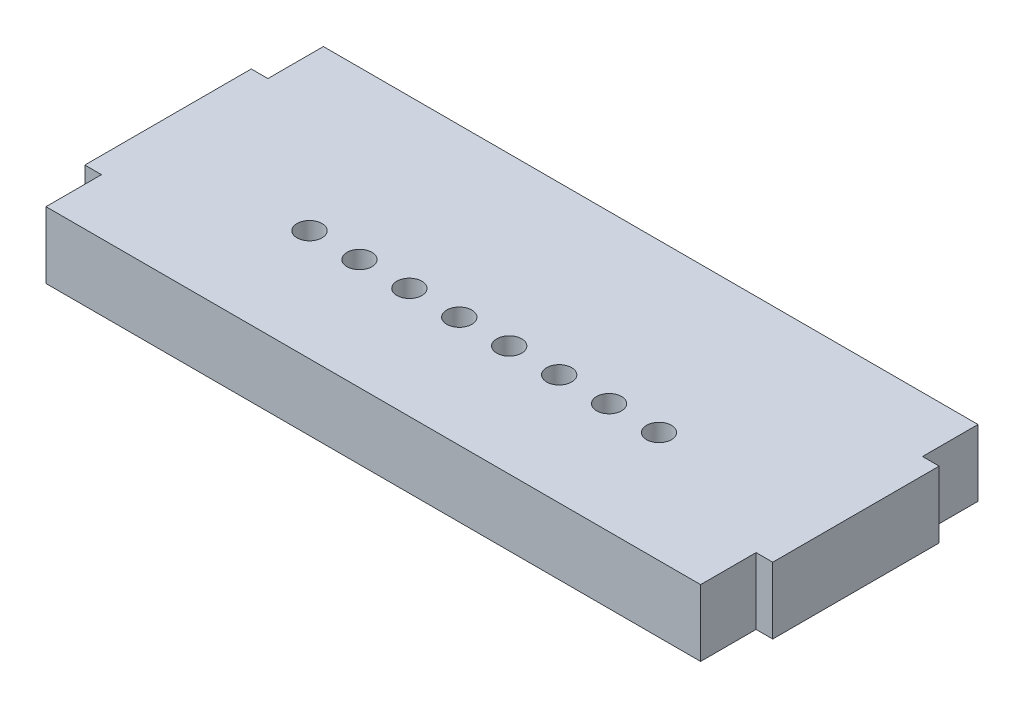
ISO-10303-21;
HEADER;
FILE_DESCRIPTION(('STEP AP214'),'2;1');
FILE_NAME('part.step','',(''),(''),'','','');
FILE_SCHEMA(('AUTOMOTIVE_DESIGN { 1 0 10303 214 1 1 1 1 }'));
ENDSEC;
DATA;
#1=APPLICATION_CONTEXT('core data for automotive mechanical design processes');
#2=APPLICATION_PROTOCOL_DEFINITION('international standard','automotive_design',2000,#1);
#3=PRODUCT_CONTEXT('',#1,'mechanical');
#4=PRODUCT('Part','Part','',(#3));
#5=PRODUCT_RELATED_PRODUCT_CATEGORY('part','',(#4));
#6=PRODUCT_DEFINITION_FORMATION('','',#4);
#7=PRODUCT_DEFINITION_CONTEXT('part definition',#1,'design');
#8=PRODUCT_DEFINITION('design','',#6,#7);
#9=PRODUCT_DEFINITION_SHAPE('','',#8);
#10=(LENGTH_UNIT() NAMED_UNIT(*) SI_UNIT(.MILLI.,.METRE.));
#11=(NAMED_UNIT(*) PLANE_ANGLE_UNIT() SI_UNIT($,.RADIAN.));
#12=(NAMED_UNIT(*) SI_UNIT($,.STERADIAN.) SOLID_ANGLE_UNIT());
#13=UNCERTAINTY_MEASURE_WITH_UNIT(LENGTH_MEASURE(1.E-05),#10,'distance_accuracy_value','');
#14=(GEOMETRIC_REPRESENTATION_CONTEXT(3) GLOBAL_UNCERTAINTY_ASSIGNED_CONTEXT((#13)) GLOBAL_UNIT_ASSIGNED_CONTEXT((#10,
#11,#12)) REPRESENTATION_CONTEXT('',''));
#15=CARTESIAN_POINT('',(0.,0.,0.));
#16=DIRECTION('',(0.,0.,1.));
#17=DIRECTION('',(1.,0.,0.));
#18=AXIS2_PLACEMENT_3D('',#15,#16,#17);
#19=CARTESIAN_POINT('',(-1.5404344466674E-12,12.,149.999999999999));
#20=DIRECTION('',(-1.,0.,0.));
#21=DIRECTION('',(0.,0.,1.));
#22=AXIS2_PLACEMENT_3D('',#19,#20,#21);
#23=PLANE('',#22);
#24=DIRECTION('',(0.,0.,-1.));
#25=VECTOR('',#24,1.);
#26=CARTESIAN_POINT('',(-1.5404344466674E-12,0.,149.999999999999));
#27=LINE('',#26,#25);
#28=CARTESIAN_POINT('',(-1.5404344466674E-12,0.,149.999999999999));
#29=VERTEX_POINT('',#28);
#30=CARTESIAN_POINT('',(-1.5404344466674E-12,0.,139.999999999999));
#31=VERTEX_POINT('',#30);
#32=EDGE_CURVE('E155',#29,#31,#27,.T.);
#33=ORIENTED_EDGE('',*,*,#32,.T.);
#34=DIRECTION('',(0.,-1.,0.));
#35=VECTOR('',#34,1.);
#36=CARTESIAN_POINT('',(-1.5404344466674E-12,12.,139.999999999999));
#37=LINE('',#36,#35);
#38=CARTESIAN_POINT('',(-1.5404344466674E-12,12.,139.999999999999));
#39=VERTEX_POINT('',#38);
#40=EDGE_CURVE('E41',#39,#31,#37,.T.);
#41=ORIENTED_EDGE('',*,*,#40,.F.);
#42=DIRECTION('',(0.,0.,-1.));
#43=VECTOR('',#42,1.);
#44=CARTESIAN_POINT('',(-1.5404344466674E-12,12.,149.999999999999));
#45=LINE('',#44,#43);
#46=CARTESIAN_POINT('',(-1.5404344466674E-12,12.,149.999999999999));
#47=VERTEX_POINT('',#46);
#48=EDGE_CURVE('E184',#47,#39,#45,.T.);
#49=ORIENTED_EDGE('',*,*,#48,.F.);
#50=DIRECTION('',(0.,-1.,0.));
#51=VECTOR('',#50,1.);
#52=CARTESIAN_POINT('',(-1.5404344466674E-12,12.,149.999999999999));
#53=LINE('',#52,#51);
#54=EDGE_CURVE('E56',#47,#29,#53,.T.);
#55=ORIENTED_EDGE('',*,*,#54,.T.);
#56=EDGE_LOOP('',(#33,#41,#49,#55));
#57=FACE_BOUND('',#56,.T.);
#58=ADVANCED_FACE('F34',(#57),#23,.F.);
#59=CARTESIAN_POINT('',(-1.5404344466674E-12,12.,139.999999999999));
#60=DIRECTION('',(0.,0.,-1.));
#61=DIRECTION('',(-1.,0.,0.));
#62=AXIS2_PLACEMENT_3D('',#59,#60,#61);
#63=PLANE('',#62);
#64=DIRECTION('',(1.,0.,0.));
#65=VECTOR('',#64,1.);
#66=CARTESIAN_POINT('',(-1.5404344466674E-12,0.,139.999999999999));
#67=LINE('',#66,#65);
#68=CARTESIAN_POINT('',(2.9999999999983,0.,139.999999999999));
#69=VERTEX_POINT('',#68);
#70=EDGE_CURVE('E157',#31,#69,#67,.T.);
#71=ORIENTED_EDGE('',*,*,#70,.T.);
#72=DIRECTION('',(0.,-1.,0.));
#73=VECTOR('',#72,1.);
#74=CARTESIAN_POINT('',(2.9999999999983,12.,139.999999999999));
#75=LINE('',#74,#73);
#76=CARTESIAN_POINT('',(2.9999999999983,12.,139.999999999999));
#77=VERTEX_POINT('',#76);
#78=EDGE_CURVE('E197',#77,#69,#75,.T.);
#79=ORIENTED_EDGE('',*,*,#78,.F.);
#80=DIRECTION('',(1.,0.,0.));
#81=VECTOR('',#80,1.);
#82=CARTESIAN_POINT('',(-1.5404344466674E-12,12.,139.999999999999));
#83=LINE('',#82,#81);
#84=EDGE_CURVE('E102',#39,#77,#83,.T.);
#85=ORIENTED_EDGE('',*,*,#84,.F.);
#86=ORIENTED_EDGE('',*,*,#40,.T.);
#87=EDGE_LOOP('',(#71,#79,#85,#86));
#88=FACE_BOUND('',#87,.T.);
#89=ADVANCED_FACE('F200',(#88),#63,.F.);
#90=CARTESIAN_POINT('',(2.9999999999983,12.,139.999999999999));
#91=DIRECTION('',(-1.,0.,0.));
#92=DIRECTION('',(0.,0.,1.));
#93=AXIS2_PLACEMENT_3D('',#90,#91,#92);
#94=PLANE('',#93);
#95=DIRECTION('',(0.,0.,-1.));
#96=VECTOR('',#95,1.);
#97=CARTESIAN_POINT('',(2.9999999999983,0.,139.999999999999));
#98=LINE('',#97,#96);
#99=CARTESIAN_POINT('',(2.9999999999983,0.,109.999999999999));
#100=VERTEX_POINT('',#99);
#101=EDGE_CURVE('E160',#69,#100,#98,.T.);
#102=ORIENTED_EDGE('',*,*,#101,.T.);
#103=DIRECTION('',(0.,-1.,0.));
#104=VECTOR('',#103,1.);
#105=CARTESIAN_POINT('',(2.9999999999983,12.,109.999999999999));
#106=LINE('',#105,#104);
#107=CARTESIAN_POINT('',(2.9999999999983,12.,109.999999999999));
#108=VERTEX_POINT('',#107);
#109=EDGE_CURVE('E195',#108,#100,#106,.T.);
#110=ORIENTED_EDGE('',*,*,#109,.F.);
#111=DIRECTION('',(0.,0.,-1.));
#112=VECTOR('',#111,1.);
#113=CARTESIAN_POINT('',(2.9999999999983,12.,139.999999999999));
#114=LINE('',#113,#112);
#115=EDGE_CURVE('E286',#77,#108,#114,.T.);
#116=ORIENTED_EDGE('',*,*,#115,.F.);
#117=ORIENTED_EDGE('',*,*,#78,.T.);
#118=EDGE_LOOP('',(#102,#110,#116,#117));
#119=FACE_BOUND('',#118,.T.);
#120=ADVANCED_FACE('F299',(#119),#94,.F.);
#121=CARTESIAN_POINT('',(-1.62370117351429E-12,12.,109.999999999999));
#122=DIRECTION('',(0.,0.,-1.));
#123=DIRECTION('',(-1.,0.,0.));
#124=AXIS2_PLACEMENT_3D('',#121,#122,#123);
#125=PLANE('',#124);
#126=DIRECTION('',(1.,0.,0.));
#127=VECTOR('',#126,1.);
#128=CARTESIAN_POINT('',(-1.62370117351429E-12,0.,109.999999999999));
#129=LINE('',#128,#127);
#130=CARTESIAN_POINT('',(-1.62370117351429E-12,0.,109.999999999999));
#131=VERTEX_POINT('',#130);
#132=EDGE_CURVE('E163',#131,#100,#129,.T.);
#133=ORIENTED_EDGE('',*,*,#132,.F.);
#134=DIRECTION('',(0.,-1.,0.));
#135=VECTOR('',#134,1.);
#136=CARTESIAN_POINT('',(-1.62370117351429E-12,12.,109.999999999999));
#137=LINE('',#136,#135);
#138=CARTESIAN_POINT('',(-1.62370117351429E-12,12.,109.999999999999));
#139=VERTEX_POINT('',#138);
#140=EDGE_CURVE('E192',#139,#131,#137,.T.);
#141=ORIENTED_EDGE('',*,*,#140,.F.);
#142=DIRECTION('',(1.,0.,0.));
#143=VECTOR('',#142,1.);
#144=CARTESIAN_POINT('',(-1.62370117351429E-12,12.,109.999999999999));
#145=LINE('',#144,#143);
#146=EDGE_CURVE('E288',#139,#108,#145,.T.);
#147=ORIENTED_EDGE('',*,*,#146,.T.);
#148=ORIENTED_EDGE('',*,*,#109,.T.);
#149=EDGE_LOOP('',(#133,#141,#147,#148));
#150=FACE_BOUND('',#149,.T.);
#151=ADVANCED_FACE('F295',(#150),#125,.T.);
#152=CARTESIAN_POINT('',(-1.59594559789866E-12,12.,99.999999999999));
#153=DIRECTION('',(-1.,0.,0.));
#154=DIRECTION('',(0.,0.,1.));
#155=AXIS2_PLACEMENT_3D('',#152,#153,#154);
#156=PLANE('',#155);
#157=DIRECTION('',(0.,0.,-1.));
#158=VECTOR('',#157,1.);
#159=CARTESIAN_POINT('',(-1.59594559789866E-12,0.,99.999999999999));
#160=LINE('',#159,#158);
#161=CARTESIAN_POINT('',(-1.59594559789866E-12,0.,99.9999999999989));
#162=VERTEX_POINT('',#161);
#163=EDGE_CURVE('E166',#131,#162,#160,.T.);
#164=ORIENTED_EDGE('',*,*,#163,.T.);
#165=DIRECTION('',(0.,1.,0.));
#166=VECTOR('',#165,1.);
#167=CARTESIAN_POINT('',(-1.59594559789866E-12,12.,99.999999999999));
#168=LINE('',#167,#166);
#169=CARTESIAN_POINT('',(-1.60982338570648E-12,12.,99.9999999999989));
#170=VERTEX_POINT('',#169);
#171=EDGE_CURVE('E47',#162,#170,#168,.T.);
#172=ORIENTED_EDGE('',*,*,#171,.T.);
#173=DIRECTION('',(0.,0.,-1.));
#174=VECTOR('',#173,1.);
#175=CARTESIAN_POINT('',(-1.62370117351429E-12,12.,109.999999999999));
#176=LINE('',#175,#174);
#177=EDGE_CURVE('E233',#139,#170,#176,.T.);
#178=ORIENTED_EDGE('',*,*,#177,.F.);
#179=ORIENTED_EDGE('',*,*,#140,.T.);
#180=EDGE_LOOP('',(#164,#172,#178,#179));
#181=FACE_BOUND('',#180,.T.);
#182=ADVANCED_FACE('F301',(#181),#156,.F.);
#183=CARTESIAN_POINT('',(-118.000000000001,12.,109.999999999999));
#184=DIRECTION('',(-1.,0.,0.));
#185=DIRECTION('',(0.,0.,1.));
#186=AXIS2_PLACEMENT_3D('',#183,#184,#185);
#187=PLANE('',#186);
#188=DIRECTION('',(0.,1.,0.));
#189=VECTOR('',#188,1.);
#190=CARTESIAN_POINT('',(-118.000000000001,12.,99.9999999999989));
#191=LINE('',#190,#189);
#192=CARTESIAN_POINT('',(-118.000000000001,0.,99.9999999999989));
#193=VERTEX_POINT('',#192);
#194=CARTESIAN_POINT('',(-118.000000000001,12.,99.9999999999989));
#195=VERTEX_POINT('',#194);
#196=EDGE_CURVE('E224',#193,#195,#191,.T.);
#197=ORIENTED_EDGE('',*,*,#196,.F.);
#198=DIRECTION('',(0.,0.,-1.));
#199=VECTOR('',#198,1.);
#200=CARTESIAN_POINT('',(-118.000000000001,0.,109.999999999999));
#201=LINE('',#200,#199);
#202=CARTESIAN_POINT('',(-118.000000000001,0.,109.999999999999));
#203=VERTEX_POINT('',#202);
#204=EDGE_CURVE('E169',#203,#193,#201,.T.);
#205=ORIENTED_EDGE('',*,*,#204,.F.);
#206=DIRECTION('',(0.,-1.,0.));
#207=VECTOR('',#206,1.);
#208=CARTESIAN_POINT('',(-118.000000000001,12.,109.999999999999));
#209=LINE('',#208,#207);
#210=CARTESIAN_POINT('',(-118.000000000001,12.,109.999999999999));
#211=VERTEX_POINT('',#210);
#212=EDGE_CURVE('E190',#211,#203,#209,.T.);
#213=ORIENTED_EDGE('',*,*,#212,.F.);
#214=DIRECTION('',(0.,0.,-1.));
#215=VECTOR('',#214,1.);
#216=CARTESIAN_POINT('',(-118.000000000001,12.,99.9999999999988));
#217=LINE('',#216,#215);
#218=EDGE_CURVE('E222',#211,#195,#217,.T.);
#219=ORIENTED_EDGE('',*,*,#218,.T.);
#220=EDGE_LOOP('',(#197,#205,#213,#219));
#221=FACE_BOUND('',#220,.T.);
#222=ADVANCED_FACE('F220',(#221),#187,.T.);
#223=CARTESIAN_POINT('',(-118.000000000001,12.,109.999999999999));
#224=DIRECTION('',(0.,0.,1.));
#225=DIRECTION('',(1.,0.,0.));
#226=AXIS2_PLACEMENT_3D('',#223,#224,#225);
#227=PLANE('',#226);
#228=DIRECTION('',(-1.,0.,0.));
#229=VECTOR('',#228,1.);
#230=CARTESIAN_POINT('',(-118.000000000001,0.,109.999999999999));
#231=LINE('',#230,#229);
#232=CARTESIAN_POINT('',(-121.000000000002,0.,109.999999999999));
#233=VERTEX_POINT('',#232);
#234=EDGE_CURVE('E172',#203,#233,#231,.T.);
#235=ORIENTED_EDGE('',*,*,#234,.T.);
#236=DIRECTION('',(0.,-1.,0.));
#237=VECTOR('',#236,1.);
#238=CARTESIAN_POINT('',(-121.000000000002,12.,109.999999999999));
#239=LINE('',#238,#237);
#240=CARTESIAN_POINT('',(-121.000000000002,12.,109.999999999999));
#241=VERTEX_POINT('',#240);
#242=EDGE_CURVE('E188',#241,#233,#239,.T.);
#243=ORIENTED_EDGE('',*,*,#242,.F.);
#244=DIRECTION('',(-1.,0.,0.));
#245=VECTOR('',#244,1.);
#246=CARTESIAN_POINT('',(-118.000000000001,12.,109.999999999999));
#247=LINE('',#246,#245);
#248=EDGE_CURVE('E216',#211,#241,#247,.T.);
#249=ORIENTED_EDGE('',*,*,#248,.F.);
#250=ORIENTED_EDGE('',*,*,#212,.T.);
#251=EDGE_LOOP('',(#235,#243,#249,#250));
#252=FACE_BOUND('',#251,.T.);
#253=ADVANCED_FACE('F214',(#252),#227,.F.);
#254=CARTESIAN_POINT('',(-121.000000000002,12.,139.999999999999));
#255=DIRECTION('',(-1.,0.,0.));
#256=DIRECTION('',(0.,0.,1.));
#257=AXIS2_PLACEMENT_3D('',#254,#255,#256);
#258=PLANE('',#257);
#259=DIRECTION('',(0.,0.,-1.));
#260=VECTOR('',#259,1.);
#261=CARTESIAN_POINT('',(-121.000000000002,0.,139.999999999999));
#262=LINE('',#261,#260);
#263=CARTESIAN_POINT('',(-121.000000000002,0.,139.999999999999));
#264=VERTEX_POINT('',#263);
#265=EDGE_CURVE('E175',#264,#233,#262,.T.);
#266=ORIENTED_EDGE('',*,*,#265,.F.);
#267=DIRECTION('',(0.,-1.,0.));
#268=VECTOR('',#267,1.);
#269=CARTESIAN_POINT('',(-121.000000000002,12.,139.999999999999));
#270=LINE('',#269,#268);
#271=CARTESIAN_POINT('',(-121.000000000002,12.,139.999999999999));
#272=VERTEX_POINT('',#271);
#273=EDGE_CURVE('E136',#272,#264,#270,.T.);
#274=ORIENTED_EDGE('',*,*,#273,.F.);
#275=DIRECTION('',(0.,0.,-1.));
#276=VECTOR('',#275,1.);
#277=CARTESIAN_POINT('',(-121.000000000002,12.,139.999999999999));
#278=LINE('',#277,#276);
#279=EDGE_CURVE('E147',#272,#241,#278,.T.);
#280=ORIENTED_EDGE('',*,*,#279,.T.);
#281=ORIENTED_EDGE('',*,*,#242,.T.);
#282=EDGE_LOOP('',(#266,#274,#280,#281));
#283=FACE_BOUND('',#282,.T.);
#284=ADVANCED_FACE('F210',(#283),#258,.T.);
#285=CARTESIAN_POINT('',(-118.000000000002,12.,139.999999999999));
#286=DIRECTION('',(0.,0.,1.));
#287=DIRECTION('',(1.,0.,0.));
#288=AXIS2_PLACEMENT_3D('',#285,#286,#287);
#289=PLANE('',#288);
#290=DIRECTION('',(-1.,0.,0.));
#291=VECTOR('',#290,1.);
#292=CARTESIAN_POINT('',(-118.000000000002,0.,139.999999999999));
#293=LINE('',#292,#291);
#294=CARTESIAN_POINT('',(-118.000000000002,0.,139.999999999999));
#295=VERTEX_POINT('',#294);
#296=EDGE_CURVE('E131',#295,#264,#293,.T.);
#297=ORIENTED_EDGE('',*,*,#296,.F.);
#298=DIRECTION('',(0.,-1.,0.));
#299=VECTOR('',#298,1.);
#300=CARTESIAN_POINT('',(-118.000000000002,12.,139.999999999999));
#301=LINE('',#300,#299);
#302=CARTESIAN_POINT('',(-118.000000000002,12.,139.999999999999));
#303=VERTEX_POINT('',#302);
#304=EDGE_CURVE('E126',#303,#295,#301,.T.);
#305=ORIENTED_EDGE('',*,*,#304,.F.);
#306=DIRECTION('',(-1.,0.,0.));
#307=VECTOR('',#306,1.);
#308=CARTESIAN_POINT('',(-118.000000000002,12.,139.999999999999));
#309=LINE('',#308,#307);
#310=EDGE_CURVE('E129',#303,#272,#309,.T.);
#311=ORIENTED_EDGE('',*,*,#310,.T.);
#312=ORIENTED_EDGE('',*,*,#273,.T.);
#313=EDGE_LOOP('',(#297,#305,#311,#312));
#314=FACE_BOUND('',#313,.T.);
#315=ADVANCED_FACE('F128',(#314),#289,.T.);
#316=CARTESIAN_POINT('',(-118.000000000002,12.,149.999999999999));
#317=DIRECTION('',(-1.,0.,0.));
#318=DIRECTION('',(0.,0.,1.));
#319=AXIS2_PLACEMENT_3D('',#316,#317,#318);
#320=PLANE('',#319);
#321=DIRECTION('',(0.,0.,-1.));
#322=VECTOR('',#321,1.);
#323=CARTESIAN_POINT('',(-118.000000000002,0.,149.999999999999));
#324=LINE('',#323,#322);
#325=CARTESIAN_POINT('',(-118.000000000002,0.,149.999999999999));
#326=VERTEX_POINT('',#325);
#327=EDGE_CURVE('E179',#326,#295,#324,.T.);
#328=ORIENTED_EDGE('',*,*,#327,.F.);
#329=DIRECTION('',(0.,-1.,0.));
#330=VECTOR('',#329,1.);
#331=CARTESIAN_POINT('',(-118.000000000002,12.,149.999999999999));
#332=LINE('',#331,#330);
#333=CARTESIAN_POINT('',(-118.000000000002,12.,149.999999999999));
#334=VERTEX_POINT('',#333);
#335=EDGE_CURVE('E137',#334,#326,#332,.T.);
#336=ORIENTED_EDGE('',*,*,#335,.F.);
#337=DIRECTION('',(0.,0.,-1.));
#338=VECTOR('',#337,1.);
#339=CARTESIAN_POINT('',(-118.000000000002,12.,149.999999999999));
#340=LINE('',#339,#338);
#341=EDGE_CURVE('E145',#334,#303,#340,.T.);
#342=ORIENTED_EDGE('',*,*,#341,.T.);
#343=ORIENTED_EDGE('',*,*,#304,.T.);
#344=EDGE_LOOP('',(#328,#336,#342,#343));
#345=FACE_BOUND('',#344,.T.);
#346=ADVANCED_FACE('F149',(#345),#320,.T.);
#347=CARTESIAN_POINT('',(-1.5404344466674E-12,12.,149.999999999999));
#348=DIRECTION('',(0.,0.,1.));
#349=DIRECTION('',(1.,0.,0.));
#350=AXIS2_PLACEMENT_3D('',#347,#348,#349);
#351=PLANE('',#350);
#352=DIRECTION('',(-1.,0.,0.));
#353=VECTOR('',#352,1.);
#354=CARTESIAN_POINT('',(-1.5404344466674E-12,0.,149.999999999999));
#355=LINE('',#354,#353);
#356=EDGE_CURVE('E181',#29,#326,#355,.T.);
#357=ORIENTED_EDGE('',*,*,#356,.F.);
#358=ORIENTED_EDGE('',*,*,#54,.F.);
#359=DIRECTION('',(-1.,0.,0.));
#360=VECTOR('',#359,1.);
#361=CARTESIAN_POINT('',(-1.5404344466674E-12,12.,149.999999999999));
#362=LINE('',#361,#360);
#363=EDGE_CURVE('E150',#47,#334,#362,.T.);
#364=ORIENTED_EDGE('',*,*,#363,.T.);
#365=ORIENTED_EDGE('',*,*,#335,.T.);
#366=EDGE_LOOP('',(#357,#358,#364,#365));
#367=FACE_BOUND('',#366,.T.);
#368=ADVANCED_FACE('F205',(#367),#351,.T.);
#369=CARTESIAN_POINT('',(0.,12.,0.));
#370=DIRECTION('',(0.,-1.,0.));
#371=DIRECTION('',(0.,0.,-1.));
#372=AXIS2_PLACEMENT_3D('',#369,#370,#371);
#373=PLANE('',#372);
#374=CARTESIAN_POINT('',(-27.5000000000016,12.,129.999999999999));
#375=DIRECTION('',(0.,-1.,0.));
#376=DIRECTION('',(0.,0.,-1.));
#377=AXIS2_PLACEMENT_3D('',#374,#375,#376);
#378=CIRCLE('',#377,2.24999999999998);
#379=CARTESIAN_POINT('',(-27.5000000000016,12.,127.749999999999));
#380=VERTEX_POINT('',#379);
#381=EDGE_CURVE('E158',#380,#380,#378,.T.);
#382=ORIENTED_EDGE('',*,*,#381,.T.);
#383=EDGE_LOOP('',(#382));
#384=FACE_BOUND('',#383,.T.);
#385=CARTESIAN_POINT('',(-36.5000000000016,12.,129.999999999999));
#386=DIRECTION('',(0.,-1.,0.));
#387=DIRECTION('',(0.,0.,-1.));
#388=AXIS2_PLACEMENT_3D('',#385,#386,#387);
#389=CIRCLE('',#388,2.25);
#390=CARTESIAN_POINT('',(-36.5000000000016,12.,127.749999999999));
#391=VERTEX_POINT('',#390);
#392=EDGE_CURVE('E246',#391,#391,#389,.T.);
#393=ORIENTED_EDGE('',*,*,#392,.T.);
#394=EDGE_LOOP('',(#393));
#395=FACE_BOUND('',#394,.T.);
#396=CARTESIAN_POINT('',(-45.5000000000016,12.,129.999999999999));
#397=DIRECTION('',(0.,-1.,0.));
#398=DIRECTION('',(0.,0.,-1.));
#399=AXIS2_PLACEMENT_3D('',#396,#397,#398);
#400=CIRCLE('',#399,2.25);
#401=CARTESIAN_POINT('',(-45.5000000000016,12.,127.749999999999));
#402=VERTEX_POINT('',#401);
#403=EDGE_CURVE('E252',#402,#402,#400,.T.);
#404=ORIENTED_EDGE('',*,*,#403,.T.);
#405=EDGE_LOOP('',(#404));
#406=FACE_BOUND('',#405,.T.);
#407=CARTESIAN_POINT('',(-54.5000000000015,12.,129.999999999999));
#408=DIRECTION('',(0.,-1.,0.));
#409=DIRECTION('',(0.,0.,-1.));
#410=AXIS2_PLACEMENT_3D('',#407,#408,#409);
#411=CIRCLE('',#410,2.25);
#412=CARTESIAN_POINT('',(-54.5000000000015,12.,127.749999999999));
#413=VERTEX_POINT('',#412);
#414=EDGE_CURVE('E258',#413,#413,#411,.T.);
#415=ORIENTED_EDGE('',*,*,#414,.T.);
#416=EDGE_LOOP('',(#415));
#417=FACE_BOUND('',#416,.T.);
#418=CARTESIAN_POINT('',(-63.5000000000016,12.,129.999999999999));
#419=DIRECTION('',(0.,-1.,0.));
#420=DIRECTION('',(0.,0.,-1.));
#421=AXIS2_PLACEMENT_3D('',#418,#419,#420);
#422=CIRCLE('',#421,2.25);
#423=CARTESIAN_POINT('',(-63.5000000000016,12.,127.749999999999));
#424=VERTEX_POINT('',#423);
#425=EDGE_CURVE('E264',#424,#424,#422,.T.);
#426=ORIENTED_EDGE('',*,*,#425,.T.);
#427=EDGE_LOOP('',(#426));
#428=FACE_BOUND('',#427,.T.);
#429=CARTESIAN_POINT('',(-72.5000000000016,12.,129.999999999999));
#430=DIRECTION('',(0.,-1.,0.));
#431=DIRECTION('',(0.,0.,-1.));
#432=AXIS2_PLACEMENT_3D('',#429,#430,#431);
#433=CIRCLE('',#432,2.25);
#434=CARTESIAN_POINT('',(-72.5000000000016,12.,127.749999999999));
#435=VERTEX_POINT('',#434);
#436=EDGE_CURVE('E270',#435,#435,#433,.T.);
#437=ORIENTED_EDGE('',*,*,#436,.T.);
#438=EDGE_LOOP('',(#437));
#439=FACE_BOUND('',#438,.T.);
#440=CARTESIAN_POINT('',(-81.5000000000015,12.,129.999999999999));
#441=DIRECTION('',(0.,-1.,0.));
#442=DIRECTION('',(0.,0.,-1.));
#443=AXIS2_PLACEMENT_3D('',#440,#441,#442);
#444=CIRCLE('',#443,2.25);
#445=CARTESIAN_POINT('',(-81.5000000000015,12.,127.749999999999));
#446=VERTEX_POINT('',#445);
#447=EDGE_CURVE('E276',#446,#446,#444,.T.);
#448=ORIENTED_EDGE('',*,*,#447,.T.);
#449=EDGE_LOOP('',(#448));
#450=FACE_BOUND('',#449,.T.);
#451=CARTESIAN_POINT('',(-90.5000000000015,12.,129.999999999999));
#452=DIRECTION('',(0.,-1.,0.));
#453=DIRECTION('',(0.,0.,-1.));
#454=AXIS2_PLACEMENT_3D('',#451,#452,#453);
#455=CIRCLE('',#454,2.25);
#456=CARTESIAN_POINT('',(-90.5000000000015,12.,127.749999999999));
#457=VERTEX_POINT('',#456);
#458=EDGE_CURVE('E237',#457,#457,#455,.T.);
#459=ORIENTED_EDGE('',*,*,#458,.T.);
#460=EDGE_LOOP('',(#459));
#461=FACE_BOUND('',#460,.T.);
#462=ORIENTED_EDGE('',*,*,#177,.T.);
#463=DIRECTION('',(1.,0.,0.));
#464=VECTOR('',#463,1.);
#465=CARTESIAN_POINT('',(-121.,12.,99.9999999999989));
#466=LINE('',#465,#464);
#467=EDGE_CURVE('E227',#195,#170,#466,.T.);
#468=ORIENTED_EDGE('',*,*,#467,.F.);
#469=ORIENTED_EDGE('',*,*,#218,.F.);
#470=ORIENTED_EDGE('',*,*,#248,.T.);
#471=ORIENTED_EDGE('',*,*,#279,.F.);
#472=ORIENTED_EDGE('',*,*,#310,.F.);
#473=ORIENTED_EDGE('',*,*,#341,.F.);
#474=ORIENTED_EDGE('',*,*,#363,.F.);
#475=ORIENTED_EDGE('',*,*,#48,.T.);
#476=ORIENTED_EDGE('',*,*,#84,.T.);
#477=ORIENTED_EDGE('',*,*,#115,.T.);
#478=ORIENTED_EDGE('',*,*,#146,.F.);
#479=EDGE_LOOP('',(#462,#468,#469,#470,#471,#472,#473,#474,#475,#476,#477,#478));
#480=FACE_BOUND('',#479,.T.);
#481=ADVANCED_FACE('F143',(#384,#395,#406,#417,#428,#439,#450,#461,#480),#373,.F.);
#482=CARTESIAN_POINT('',(0.,0.,0.));
#483=DIRECTION('',(0.,-1.,0.));
#484=DIRECTION('',(0.,0.,-1.));
#485=AXIS2_PLACEMENT_3D('',#482,#483,#484);
#486=PLANE('',#485);
#487=DIRECTION('',(-1.,0.,0.));
#488=VECTOR('',#487,1.);
#489=CARTESIAN_POINT('',(0.,0.,99.9999999999989));
#490=LINE('',#489,#488);
#491=EDGE_CURVE('E11',#162,#193,#490,.T.);
#492=ORIENTED_EDGE('',*,*,#491,.F.);
#493=ORIENTED_EDGE('',*,*,#163,.F.);
#494=ORIENTED_EDGE('',*,*,#132,.T.);
#495=ORIENTED_EDGE('',*,*,#101,.F.);
#496=ORIENTED_EDGE('',*,*,#70,.F.);
#497=ORIENTED_EDGE('',*,*,#32,.F.);
#498=ORIENTED_EDGE('',*,*,#356,.T.);
#499=ORIENTED_EDGE('',*,*,#327,.T.);
#500=ORIENTED_EDGE('',*,*,#296,.T.);
#501=ORIENTED_EDGE('',*,*,#265,.T.);
#502=ORIENTED_EDGE('',*,*,#234,.F.);
#503=ORIENTED_EDGE('',*,*,#204,.T.);
#504=EDGE_LOOP('',(#492,#493,#494,#495,#496,#497,#498,#499,#500,#501,#502,#503));
#505=FACE_BOUND('',#504,.T.);
#506=CARTESIAN_POINT('',(-27.5000000000016,0.,129.999999999999));
#507=DIRECTION('',(0.,-1.,0.));
#508=DIRECTION('',(0.,0.,-1.));
#509=AXIS2_PLACEMENT_3D('',#506,#507,#508);
#510=CIRCLE('',#509,2.24999999999998);
#511=CARTESIAN_POINT('',(-27.5000000000016,0.,127.749999999999));
#512=VERTEX_POINT('',#511);
#513=EDGE_CURVE('E240',#512,#512,#510,.T.);
#514=ORIENTED_EDGE('',*,*,#513,.F.);
#515=EDGE_LOOP('',(#514));
#516=FACE_BOUND('',#515,.T.);
#517=CARTESIAN_POINT('',(-36.5000000000016,0.,129.999999999999));
#518=DIRECTION('',(0.,-1.,0.));
#519=DIRECTION('',(0.,0.,-1.));
#520=AXIS2_PLACEMENT_3D('',#517,#518,#519);
#521=CIRCLE('',#520,2.25);
#522=CARTESIAN_POINT('',(-36.5000000000016,0.,127.749999999999));
#523=VERTEX_POINT('',#522);
#524=EDGE_CURVE('E243',#523,#523,#521,.T.);
#525=ORIENTED_EDGE('',*,*,#524,.F.);
#526=EDGE_LOOP('',(#525));
#527=FACE_BOUND('',#526,.T.);
#528=CARTESIAN_POINT('',(-45.5000000000016,0.,129.999999999999));
#529=DIRECTION('',(0.,-1.,0.));
#530=DIRECTION('',(0.,0.,-1.));
#531=AXIS2_PLACEMENT_3D('',#528,#529,#530);
#532=CIRCLE('',#531,2.25);
#533=CARTESIAN_POINT('',(-45.5000000000016,0.,127.749999999999));
#534=VERTEX_POINT('',#533);
#535=EDGE_CURVE('E249',#534,#534,#532,.T.);
#536=ORIENTED_EDGE('',*,*,#535,.F.);
#537=EDGE_LOOP('',(#536));
#538=FACE_BOUND('',#537,.T.);
#539=CARTESIAN_POINT('',(-54.5000000000015,0.,129.999999999999));
#540=DIRECTION('',(0.,-1.,0.));
#541=DIRECTION('',(0.,0.,-1.));
#542=AXIS2_PLACEMENT_3D('',#539,#540,#541);
#543=CIRCLE('',#542,2.25);
#544=CARTESIAN_POINT('',(-54.5000000000015,0.,127.749999999999));
#545=VERTEX_POINT('',#544);
#546=EDGE_CURVE('E255',#545,#545,#543,.T.);
#547=ORIENTED_EDGE('',*,*,#546,.F.);
#548=EDGE_LOOP('',(#547));
#549=FACE_BOUND('',#548,.T.);
#550=CARTESIAN_POINT('',(-63.5000000000016,0.,129.999999999999));
#551=DIRECTION('',(0.,-1.,0.));
#552=DIRECTION('',(0.,0.,-1.));
#553=AXIS2_PLACEMENT_3D('',#550,#551,#552);
#554=CIRCLE('',#553,2.25);
#555=CARTESIAN_POINT('',(-63.5000000000016,0.,127.749999999999));
#556=VERTEX_POINT('',#555);
#557=EDGE_CURVE('E261',#556,#556,#554,.T.);
#558=ORIENTED_EDGE('',*,*,#557,.F.);
#559=EDGE_LOOP('',(#558));
#560=FACE_BOUND('',#559,.T.);
#561=CARTESIAN_POINT('',(-72.5000000000016,0.,129.999999999999));
#562=DIRECTION('',(0.,-1.,0.));
#563=DIRECTION('',(0.,0.,-1.));
#564=AXIS2_PLACEMENT_3D('',#561,#562,#563);
#565=CIRCLE('',#564,2.25);
#566=CARTESIAN_POINT('',(-72.5000000000016,0.,127.749999999999));
#567=VERTEX_POINT('',#566);
#568=EDGE_CURVE('E267',#567,#567,#565,.T.);
#569=ORIENTED_EDGE('',*,*,#568,.F.);
#570=EDGE_LOOP('',(#569));
#571=FACE_BOUND('',#570,.T.);
#572=CARTESIAN_POINT('',(-81.5000000000015,0.,129.999999999999));
#573=DIRECTION('',(0.,-1.,0.));
#574=DIRECTION('',(0.,0.,-1.));
#575=AXIS2_PLACEMENT_3D('',#572,#573,#574);
#576=CIRCLE('',#575,2.25);
#577=CARTESIAN_POINT('',(-81.5000000000015,0.,127.749999999999));
#578=VERTEX_POINT('',#577);
#579=EDGE_CURVE('E273',#578,#578,#576,.T.);
#580=ORIENTED_EDGE('',*,*,#579,.F.);
#581=EDGE_LOOP('',(#580));
#582=FACE_BOUND('',#581,.T.);
#583=CARTESIAN_POINT('',(-90.5000000000015,0.,129.999999999999));
#584=DIRECTION('',(0.,-1.,0.));
#585=DIRECTION('',(0.,0.,-1.));
#586=AXIS2_PLACEMENT_3D('',#583,#584,#585);
#587=CIRCLE('',#586,2.25);
#588=CARTESIAN_POINT('',(-90.5000000000015,0.,127.749999999999));
#589=VERTEX_POINT('',#588);
#590=EDGE_CURVE('E279',#589,#589,#587,.T.);
#591=ORIENTED_EDGE('',*,*,#590,.F.);
#592=EDGE_LOOP('',(#591));
#593=FACE_BOUND('',#592,.T.);
#594=ADVANCED_FACE('F202',(#505,#516,#527,#538,#549,#560,#571,#582,#593),#486,.T.);
#595=CARTESIAN_POINT('',(-90.5000000000015,12.,129.999999999999));
#596=DIRECTION('',(0.,-1.,0.));
#597=DIRECTION('',(0.,0.,-1.));
#598=AXIS2_PLACEMENT_3D('',#595,#596,#597);
#599=CYLINDRICAL_SURFACE('',#598,2.25);
#600=ORIENTED_EDGE('',*,*,#458,.F.);
#601=EDGE_LOOP('',(#600));
#602=FACE_BOUND('',#601,.T.);
#603=ORIENTED_EDGE('',*,*,#590,.T.);
#604=EDGE_LOOP('',(#603));
#605=FACE_BOUND('',#604,.T.);
#606=ADVANCED_FACE('F400',(#602,#605),#599,.F.);
#607=CARTESIAN_POINT('',(-81.5000000000015,12.,129.999999999999));
#608=DIRECTION('',(0.,-1.,0.));
#609=DIRECTION('',(0.,0.,-1.));
#610=AXIS2_PLACEMENT_3D('',#607,#608,#609);
#611=CYLINDRICAL_SURFACE('',#610,2.25);
#612=ORIENTED_EDGE('',*,*,#447,.F.);
#613=EDGE_LOOP('',(#612));
#614=FACE_BOUND('',#613,.T.);
#615=ORIENTED_EDGE('',*,*,#579,.T.);
#616=EDGE_LOOP('',(#615));
#617=FACE_BOUND('',#616,.T.);
#618=ADVANCED_FACE('F409',(#614,#617),#611,.F.);
#619=CARTESIAN_POINT('',(-72.5000000000016,12.,129.999999999999));
#620=DIRECTION('',(0.,-1.,0.));
#621=DIRECTION('',(0.,0.,-1.));
#622=AXIS2_PLACEMENT_3D('',#619,#620,#621);
#623=CYLINDRICAL_SURFACE('',#622,2.25);
#624=ORIENTED_EDGE('',*,*,#436,.F.);
#625=EDGE_LOOP('',(#624));
#626=FACE_BOUND('',#625,.T.);
#627=ORIENTED_EDGE('',*,*,#568,.T.);
#628=EDGE_LOOP('',(#627));
#629=FACE_BOUND('',#628,.T.);
#630=ADVANCED_FACE('F420',(#626,#629),#623,.F.);
#631=CARTESIAN_POINT('',(-63.5000000000016,12.,129.999999999999));
#632=DIRECTION('',(0.,-1.,0.));
#633=DIRECTION('',(0.,0.,-1.));
#634=AXIS2_PLACEMENT_3D('',#631,#632,#633);
#635=CYLINDRICAL_SURFACE('',#634,2.25);
#636=ORIENTED_EDGE('',*,*,#425,.F.);
#637=EDGE_LOOP('',(#636));
#638=FACE_BOUND('',#637,.T.);
#639=ORIENTED_EDGE('',*,*,#557,.T.);
#640=EDGE_LOOP('',(#639));
#641=FACE_BOUND('',#640,.T.);
#642=ADVANCED_FACE('F430',(#638,#641),#635,.F.);
#643=CARTESIAN_POINT('',(-54.5000000000015,12.,129.999999999999));
#644=DIRECTION('',(0.,-1.,0.));
#645=DIRECTION('',(0.,0.,-1.));
#646=AXIS2_PLACEMENT_3D('',#643,#644,#645);
#647=CYLINDRICAL_SURFACE('',#646,2.25);
#648=ORIENTED_EDGE('',*,*,#414,.F.);
#649=EDGE_LOOP('',(#648));
#650=FACE_BOUND('',#649,.T.);
#651=ORIENTED_EDGE('',*,*,#546,.T.);
#652=EDGE_LOOP('',(#651));
#653=FACE_BOUND('',#652,.T.);
#654=ADVANCED_FACE('F440',(#650,#653),#647,.F.);
#655=CARTESIAN_POINT('',(-45.5000000000016,12.,129.999999999999));
#656=DIRECTION('',(0.,-1.,0.));
#657=DIRECTION('',(0.,0.,-1.));
#658=AXIS2_PLACEMENT_3D('',#655,#656,#657);
#659=CYLINDRICAL_SURFACE('',#658,2.25);
#660=ORIENTED_EDGE('',*,*,#403,.F.);
#661=EDGE_LOOP('',(#660));
#662=FACE_BOUND('',#661,.T.);
#663=ORIENTED_EDGE('',*,*,#535,.T.);
#664=EDGE_LOOP('',(#663));
#665=FACE_BOUND('',#664,.T.);
#666=ADVANCED_FACE('F450',(#662,#665),#659,.F.);
#667=CARTESIAN_POINT('',(-36.5000000000016,12.,129.999999999999));
#668=DIRECTION('',(0.,-1.,0.));
#669=DIRECTION('',(0.,0.,-1.));
#670=AXIS2_PLACEMENT_3D('',#667,#668,#669);
#671=CYLINDRICAL_SURFACE('',#670,2.25);
#672=ORIENTED_EDGE('',*,*,#392,.F.);
#673=EDGE_LOOP('',(#672));
#674=FACE_BOUND('',#673,.T.);
#675=ORIENTED_EDGE('',*,*,#524,.T.);
#676=EDGE_LOOP('',(#675));
#677=FACE_BOUND('',#676,.T.);
#678=ADVANCED_FACE('F460',(#674,#677),#671,.F.);
#679=CARTESIAN_POINT('',(-27.5000000000016,12.,129.999999999999));
#680=DIRECTION('',(0.,-1.,0.));
#681=DIRECTION('',(0.,0.,-1.));
#682=AXIS2_PLACEMENT_3D('',#679,#680,#681);
#683=CYLINDRICAL_SURFACE('',#682,2.24999999999998);
#684=ORIENTED_EDGE('',*,*,#381,.F.);
#685=EDGE_LOOP('',(#684));
#686=FACE_BOUND('',#685,.T.);
#687=ORIENTED_EDGE('',*,*,#513,.T.);
#688=EDGE_LOOP('',(#687));
#689=FACE_BOUND('',#688,.T.);
#690=ADVANCED_FACE('F469',(#686,#689),#683,.F.);
#691=CARTESIAN_POINT('',(-121.,0.,99.9999999999989));
#692=DIRECTION('',(0.,0.,1.));
#693=DIRECTION('',(1.,0.,0.));
#694=AXIS2_PLACEMENT_3D('',#691,#692,#693);
#695=PLANE('',#694);
#696=ORIENTED_EDGE('',*,*,#491,.T.);
#697=ORIENTED_EDGE('',*,*,#196,.T.);
#698=ORIENTED_EDGE('',*,*,#467,.T.);
#699=ORIENTED_EDGE('',*,*,#171,.F.);
#700=EDGE_LOOP('',(#696,#697,#698,#699));
#701=FACE_BOUND('',#700,.T.);
#702=ADVANCED_FACE('F229',(#701),#695,.F.);
#703=CLOSED_SHELL('',(#58,#89,#120,#151,#182,#222,#253,#284,#315,#346,#368,#481,#594,#606,#618,
#630,#642,#654,#666,#678,#690,#702));
#704=MANIFOLD_SOLID_BREP('B2',#703);
#705=ADVANCED_BREP_SHAPE_REPRESENTATION('',(#18,#704),#14);
#706=SHAPE_DEFINITION_REPRESENTATION(#9,#705);
ENDSEC;
END-ISO-10303-21;
